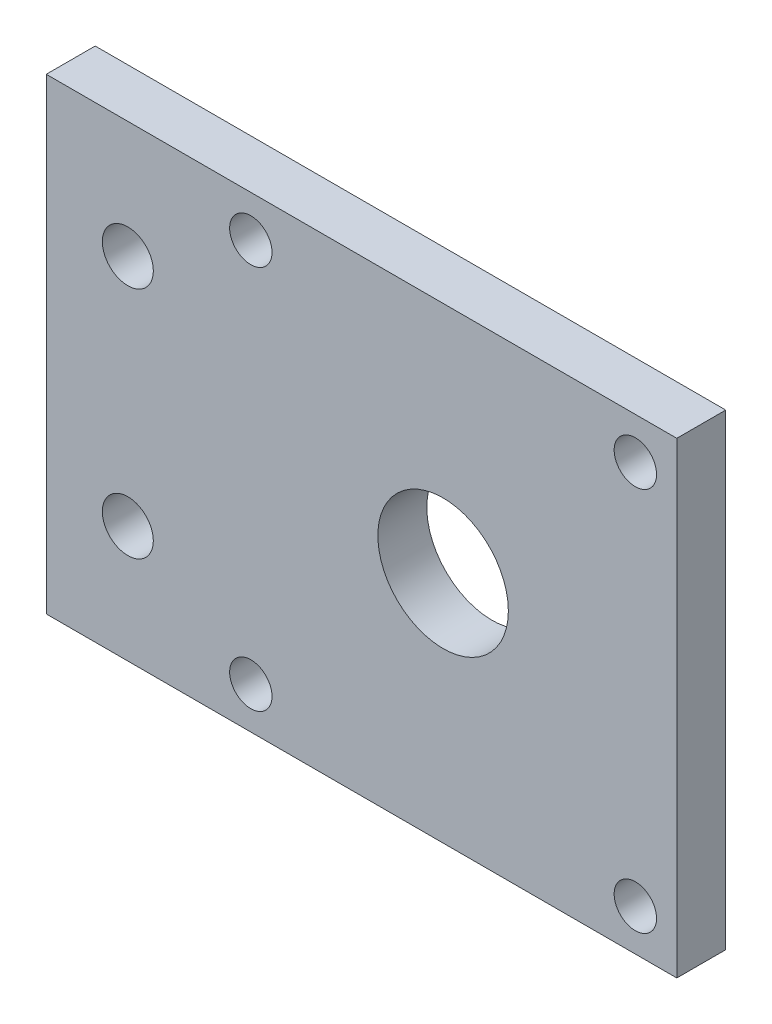
ISO-10303-21;
HEADER;
FILE_DESCRIPTION(('STEP AP214'),'2;1');
FILE_NAME('part.step','',(''),(''),'','','');
FILE_SCHEMA(('AUTOMOTIVE_DESIGN { 1 0 10303 214 1 1 1 1 }'));
ENDSEC;
DATA;
#1=APPLICATION_CONTEXT('core data for automotive mechanical design processes');
#2=APPLICATION_PROTOCOL_DEFINITION('international standard','automotive_design',2000,#1);
#3=PRODUCT_CONTEXT('',#1,'mechanical');
#4=PRODUCT('Part','Part','',(#3));
#5=PRODUCT_RELATED_PRODUCT_CATEGORY('part','',(#4));
#6=PRODUCT_DEFINITION_FORMATION('','',#4);
#7=PRODUCT_DEFINITION_CONTEXT('part definition',#1,'design');
#8=PRODUCT_DEFINITION('design','',#6,#7);
#9=PRODUCT_DEFINITION_SHAPE('','',#8);
#10=(LENGTH_UNIT() NAMED_UNIT(*) SI_UNIT(.MILLI.,.METRE.));
#11=(NAMED_UNIT(*) PLANE_ANGLE_UNIT() SI_UNIT($,.RADIAN.));
#12=(NAMED_UNIT(*) SI_UNIT($,.STERADIAN.) SOLID_ANGLE_UNIT());
#13=UNCERTAINTY_MEASURE_WITH_UNIT(LENGTH_MEASURE(1.E-05),#10,'distance_accuracy_value','');
#14=(GEOMETRIC_REPRESENTATION_CONTEXT(3) GLOBAL_UNCERTAINTY_ASSIGNED_CONTEXT((#13)) GLOBAL_UNIT_ASSIGNED_CONTEXT((#10,
#11,#12)) REPRESENTATION_CONTEXT('',''));
#15=CARTESIAN_POINT('',(0.,0.,0.));
#16=DIRECTION('',(0.,0.,1.));
#17=DIRECTION('',(1.,0.,0.));
#18=AXIS2_PLACEMENT_3D('',#15,#16,#17);
#19=CARTESIAN_POINT('',(38.65,-28.65,6.));
#20=DIRECTION('',(-1.,0.,0.));
#21=DIRECTION('',(0.,0.,1.));
#22=AXIS2_PLACEMENT_3D('',#19,#20,#21);
#23=PLANE('',#22);
#24=DIRECTION('',(0.,1.,0.));
#25=VECTOR('',#24,1.);
#26=CARTESIAN_POINT('',(38.65,-28.65,0.));
#27=LINE('',#26,#25);
#28=CARTESIAN_POINT('',(38.65,-28.65,0.));
#29=VERTEX_POINT('',#28);
#30=CARTESIAN_POINT('',(38.65,28.65,0.));
#31=VERTEX_POINT('',#30);
#32=EDGE_CURVE('E101',#29,#31,#27,.T.);
#33=ORIENTED_EDGE('',*,*,#32,.T.);
#34=DIRECTION('',(0.,0.,-1.));
#35=VECTOR('',#34,1.);
#36=CARTESIAN_POINT('',(38.65,28.65,6.));
#37=LINE('',#36,#35);
#38=CARTESIAN_POINT('',(38.65,28.65,6.));
#39=VERTEX_POINT('',#38);
#40=EDGE_CURVE('E11',#39,#31,#37,.T.);
#41=ORIENTED_EDGE('',*,*,#40,.F.);
#42=DIRECTION('',(0.,1.,0.));
#43=VECTOR('',#42,1.);
#44=CARTESIAN_POINT('',(38.65,-28.65,6.));
#45=LINE('',#44,#43);
#46=CARTESIAN_POINT('',(38.65,-28.65,6.));
#47=VERTEX_POINT('',#46);
#48=EDGE_CURVE('E88',#47,#39,#45,.T.);
#49=ORIENTED_EDGE('',*,*,#48,.F.);
#50=DIRECTION('',(0.,0.,-1.));
#51=VECTOR('',#50,1.);
#52=CARTESIAN_POINT('',(38.65,-28.65,6.));
#53=LINE('',#52,#51);
#54=EDGE_CURVE('E97',#47,#29,#53,.T.);
#55=ORIENTED_EDGE('',*,*,#54,.T.);
#56=EDGE_LOOP('',(#33,#41,#49,#55));
#57=FACE_BOUND('',#56,.T.);
#58=ADVANCED_FACE('F36',(#57),#23,.F.);
#59=CARTESIAN_POINT('',(-38.65,28.65,6.));
#60=DIRECTION('',(0.,-1.,0.));
#61=DIRECTION('',(0.,0.,-1.));
#62=AXIS2_PLACEMENT_3D('',#59,#60,#61);
#63=PLANE('',#62);
#64=DIRECTION('',(-1.,0.,0.));
#65=VECTOR('',#64,1.);
#66=CARTESIAN_POINT('',(-38.65,28.65,0.));
#67=LINE('',#66,#65);
#68=CARTESIAN_POINT('',(-38.65,28.65,0.));
#69=VERTEX_POINT('',#68);
#70=EDGE_CURVE('E92',#31,#69,#67,.T.);
#71=ORIENTED_EDGE('',*,*,#70,.T.);
#72=DIRECTION('',(0.,0.,-1.));
#73=VECTOR('',#72,1.);
#74=CARTESIAN_POINT('',(-38.65,28.65,6.));
#75=LINE('',#74,#73);
#76=CARTESIAN_POINT('',(-38.65,28.65,6.));
#77=VERTEX_POINT('',#76);
#78=EDGE_CURVE('E45',#77,#69,#75,.T.);
#79=ORIENTED_EDGE('',*,*,#78,.F.);
#80=DIRECTION('',(-1.,0.,0.));
#81=VECTOR('',#80,1.);
#82=CARTESIAN_POINT('',(-38.65,28.65,6.));
#83=LINE('',#82,#81);
#84=EDGE_CURVE('E83',#39,#77,#83,.T.);
#85=ORIENTED_EDGE('',*,*,#84,.F.);
#86=ORIENTED_EDGE('',*,*,#40,.T.);
#87=EDGE_LOOP('',(#71,#79,#85,#86));
#88=FACE_BOUND('',#87,.T.);
#89=ADVANCED_FACE('F91',(#88),#63,.F.);
#90=CARTESIAN_POINT('',(-38.65,-28.65,6.));
#91=DIRECTION('',(1.,0.,0.));
#92=DIRECTION('',(0.,0.,-1.));
#93=AXIS2_PLACEMENT_3D('',#90,#91,#92);
#94=PLANE('',#93);
#95=DIRECTION('',(0.,-1.,0.));
#96=VECTOR('',#95,1.);
#97=CARTESIAN_POINT('',(-38.65,-28.65,0.));
#98=LINE('',#97,#96);
#99=CARTESIAN_POINT('',(-38.65,-28.65,0.));
#100=VERTEX_POINT('',#99);
#101=EDGE_CURVE('E70',#69,#100,#98,.T.);
#102=ORIENTED_EDGE('',*,*,#101,.T.);
#103=DIRECTION('',(0.,0.,-1.));
#104=VECTOR('',#103,1.);
#105=CARTESIAN_POINT('',(-38.65,-28.65,6.));
#106=LINE('',#105,#104);
#107=CARTESIAN_POINT('',(-38.65,-28.65,6.));
#108=VERTEX_POINT('',#107);
#109=EDGE_CURVE('E93',#108,#100,#106,.T.);
#110=ORIENTED_EDGE('',*,*,#109,.F.);
#111=DIRECTION('',(0.,-1.,0.));
#112=VECTOR('',#111,1.);
#113=CARTESIAN_POINT('',(-38.65,-28.65,6.));
#114=LINE('',#113,#112);
#115=EDGE_CURVE('E86',#77,#108,#114,.T.);
#116=ORIENTED_EDGE('',*,*,#115,.F.);
#117=ORIENTED_EDGE('',*,*,#78,.T.);
#118=EDGE_LOOP('',(#102,#110,#116,#117));
#119=FACE_BOUND('',#118,.T.);
#120=ADVANCED_FACE('F95',(#119),#94,.F.);
#121=CARTESIAN_POINT('',(-38.65,-28.65,6.));
#122=DIRECTION('',(0.,1.,0.));
#123=DIRECTION('',(0.,0.,1.));
#124=AXIS2_PLACEMENT_3D('',#121,#122,#123);
#125=PLANE('',#124);
#126=DIRECTION('',(1.,0.,0.));
#127=VECTOR('',#126,1.);
#128=CARTESIAN_POINT('',(-38.65,-28.65,0.));
#129=LINE('',#128,#127);
#130=EDGE_CURVE('E76',#100,#29,#129,.T.);
#131=ORIENTED_EDGE('',*,*,#130,.T.);
#132=ORIENTED_EDGE('',*,*,#54,.F.);
#133=DIRECTION('',(1.,0.,0.));
#134=VECTOR('',#133,1.);
#135=CARTESIAN_POINT('',(-38.65,-28.65,6.));
#136=LINE('',#135,#134);
#137=EDGE_CURVE('E53',#108,#47,#136,.T.);
#138=ORIENTED_EDGE('',*,*,#137,.F.);
#139=ORIENTED_EDGE('',*,*,#109,.T.);
#140=EDGE_LOOP('',(#131,#132,#138,#139));
#141=FACE_BOUND('',#140,.T.);
#142=ADVANCED_FACE('F109',(#141),#125,.F.);
#143=CARTESIAN_POINT('',(0.,0.,6.));
#144=DIRECTION('',(0.,0.,-1.));
#145=DIRECTION('',(-1.,0.,0.));
#146=AXIS2_PLACEMENT_3D('',#143,#144,#145);
#147=PLANE('',#146);
#148=CARTESIAN_POINT('',(-28.65,14.325,6.));
#149=DIRECTION('',(0.,0.,1.));
#150=DIRECTION('',(1.,0.,0.));
#151=AXIS2_PLACEMENT_3D('',#148,#149,#150);
#152=CIRCLE('',#151,3.12499999999999);
#153=CARTESIAN_POINT('',(-25.525,14.325,6.));
#154=VERTEX_POINT('',#153);
#155=EDGE_CURVE('E150',#154,#154,#152,.T.);
#156=ORIENTED_EDGE('',*,*,#155,.F.);
#157=EDGE_LOOP('',(#156));
#158=FACE_BOUND('',#157,.T.);
#159=CARTESIAN_POINT('',(-28.65,-14.325,6.));
#160=DIRECTION('',(0.,0.,1.));
#161=DIRECTION('',(1.,0.,0.));
#162=AXIS2_PLACEMENT_3D('',#159,#160,#161);
#163=CIRCLE('',#162,3.12499999999999);
#164=CARTESIAN_POINT('',(-25.525,-14.325,6.));
#165=VERTEX_POINT('',#164);
#166=EDGE_CURVE('E147',#165,#165,#163,.T.);
#167=ORIENTED_EDGE('',*,*,#166,.F.);
#168=EDGE_LOOP('',(#167));
#169=FACE_BOUND('',#168,.T.);
#170=CARTESIAN_POINT('',(-13.57,23.57,6.));
#171=DIRECTION('',(0.,0.,1.));
#172=DIRECTION('',(1.,0.,0.));
#173=AXIS2_PLACEMENT_3D('',#170,#171,#172);
#174=CIRCLE('',#173,2.6);
#175=CARTESIAN_POINT('',(-10.97,23.57,6.));
#176=VERTEX_POINT('',#175);
#177=EDGE_CURVE('E128',#176,#176,#174,.T.);
#178=ORIENTED_EDGE('',*,*,#177,.F.);
#179=EDGE_LOOP('',(#178));
#180=FACE_BOUND('',#179,.T.);
#181=CARTESIAN_POINT('',(33.57,-23.57,6.));
#182=DIRECTION('',(0.,0.,1.));
#183=DIRECTION('',(1.,0.,0.));
#184=AXIS2_PLACEMENT_3D('',#181,#182,#183);
#185=CIRCLE('',#184,2.6);
#186=CARTESIAN_POINT('',(36.17,-23.57,6.));
#187=VERTEX_POINT('',#186);
#188=EDGE_CURVE('E121',#187,#187,#185,.T.);
#189=ORIENTED_EDGE('',*,*,#188,.F.);
#190=EDGE_LOOP('',(#189));
#191=FACE_BOUND('',#190,.T.);
#192=CARTESIAN_POINT('',(33.57,23.57,6.));
#193=DIRECTION('',(0.,0.,1.));
#194=DIRECTION('',(1.,0.,0.));
#195=AXIS2_PLACEMENT_3D('',#192,#193,#194);
#196=CIRCLE('',#195,2.6);
#197=CARTESIAN_POINT('',(36.17,23.57,6.));
#198=VERTEX_POINT('',#197);
#199=EDGE_CURVE('E140',#198,#198,#196,.T.);
#200=ORIENTED_EDGE('',*,*,#199,.F.);
#201=EDGE_LOOP('',(#200));
#202=FACE_BOUND('',#201,.T.);
#203=CARTESIAN_POINT('',(-13.57,-23.57,6.));
#204=DIRECTION('',(0.,0.,1.));
#205=DIRECTION('',(1.,0.,0.));
#206=AXIS2_PLACEMENT_3D('',#203,#204,#205);
#207=CIRCLE('',#206,2.6);
#208=CARTESIAN_POINT('',(-10.97,-23.57,6.));
#209=VERTEX_POINT('',#208);
#210=EDGE_CURVE('E133',#209,#209,#207,.T.);
#211=ORIENTED_EDGE('',*,*,#210,.F.);
#212=EDGE_LOOP('',(#211));
#213=FACE_BOUND('',#212,.T.);
#214=CARTESIAN_POINT('',(10.,0.,6.));
#215=DIRECTION('',(0.,0.,1.));
#216=DIRECTION('',(1.,0.,0.));
#217=AXIS2_PLACEMENT_3D('',#214,#215,#216);
#218=CIRCLE('',#217,8.);
#219=CARTESIAN_POINT('',(18.,0.,6.));
#220=VERTEX_POINT('',#219);
#221=EDGE_CURVE('E115',#220,#220,#218,.T.);
#222=ORIENTED_EDGE('',*,*,#221,.F.);
#223=EDGE_LOOP('',(#222));
#224=FACE_BOUND('',#223,.T.);
#225=ORIENTED_EDGE('',*,*,#48,.T.);
#226=ORIENTED_EDGE('',*,*,#84,.T.);
#227=ORIENTED_EDGE('',*,*,#115,.T.);
#228=ORIENTED_EDGE('',*,*,#137,.T.);
#229=EDGE_LOOP('',(#225,#226,#227,#228));
#230=FACE_BOUND('',#229,.T.);
#231=ADVANCED_FACE('F84',(#158,#169,#180,#191,#202,#213,#224,#230),#147,.F.);
#232=CARTESIAN_POINT('',(0.,0.,0.));
#233=DIRECTION('',(0.,0.,-1.));
#234=DIRECTION('',(-1.,0.,0.));
#235=AXIS2_PLACEMENT_3D('',#232,#233,#234);
#236=PLANE('',#235);
#237=CARTESIAN_POINT('',(-28.65,14.325,0.));
#238=DIRECTION('',(0.,0.,-1.));
#239=DIRECTION('',(-1.,0.,0.));
#240=AXIS2_PLACEMENT_3D('',#237,#238,#239);
#241=CIRCLE('',#240,3.12499999999999);
#242=CARTESIAN_POINT('',(-31.775,14.325,0.));
#243=VERTEX_POINT('',#242);
#244=EDGE_CURVE('E39',#243,#243,#241,.T.);
#245=ORIENTED_EDGE('',*,*,#244,.F.);
#246=EDGE_LOOP('',(#245));
#247=FACE_BOUND('',#246,.T.);
#248=CARTESIAN_POINT('',(-28.65,-14.325,0.));
#249=DIRECTION('',(0.,0.,-1.));
#250=DIRECTION('',(-1.,0.,0.));
#251=AXIS2_PLACEMENT_3D('',#248,#249,#250);
#252=CIRCLE('',#251,3.12499999999999);
#253=CARTESIAN_POINT('',(-31.775,-14.325,0.));
#254=VERTEX_POINT('',#253);
#255=EDGE_CURVE('E137',#254,#254,#252,.T.);
#256=ORIENTED_EDGE('',*,*,#255,.F.);
#257=EDGE_LOOP('',(#256));
#258=FACE_BOUND('',#257,.T.);
#259=CARTESIAN_POINT('',(-13.57,23.57,0.));
#260=DIRECTION('',(0.,0.,1.));
#261=DIRECTION('',(1.,0.,0.));
#262=AXIS2_PLACEMENT_3D('',#259,#260,#261);
#263=CIRCLE('',#262,2.6);
#264=CARTESIAN_POINT('',(-10.97,23.57,0.));
#265=VERTEX_POINT('',#264);
#266=EDGE_CURVE('E118',#265,#265,#263,.T.);
#267=ORIENTED_EDGE('',*,*,#266,.T.);
#268=EDGE_LOOP('',(#267));
#269=FACE_BOUND('',#268,.T.);
#270=CARTESIAN_POINT('',(33.57,-23.57,0.));
#271=DIRECTION('',(0.,0.,1.));
#272=DIRECTION('',(1.,0.,0.));
#273=AXIS2_PLACEMENT_3D('',#270,#271,#272);
#274=CIRCLE('',#273,2.6);
#275=CARTESIAN_POINT('',(36.17,-23.57,0.));
#276=VERTEX_POINT('',#275);
#277=EDGE_CURVE('E124',#276,#276,#274,.T.);
#278=ORIENTED_EDGE('',*,*,#277,.T.);
#279=EDGE_LOOP('',(#278));
#280=FACE_BOUND('',#279,.T.);
#281=CARTESIAN_POINT('',(33.57,23.57,0.));
#282=DIRECTION('',(0.,0.,1.));
#283=DIRECTION('',(1.,0.,0.));
#284=AXIS2_PLACEMENT_3D('',#281,#282,#283);
#285=CIRCLE('',#284,2.6);
#286=CARTESIAN_POINT('',(36.17,23.57,0.));
#287=VERTEX_POINT('',#286);
#288=EDGE_CURVE('E125',#287,#287,#285,.T.);
#289=ORIENTED_EDGE('',*,*,#288,.T.);
#290=EDGE_LOOP('',(#289));
#291=FACE_BOUND('',#290,.T.);
#292=CARTESIAN_POINT('',(-13.57,-23.57,0.));
#293=DIRECTION('',(0.,0.,1.));
#294=DIRECTION('',(1.,0.,0.));
#295=AXIS2_PLACEMENT_3D('',#292,#293,#294);
#296=CIRCLE('',#295,2.6);
#297=CARTESIAN_POINT('',(-10.97,-23.57,0.));
#298=VERTEX_POINT('',#297);
#299=EDGE_CURVE('E136',#298,#298,#296,.T.);
#300=ORIENTED_EDGE('',*,*,#299,.T.);
#301=EDGE_LOOP('',(#300));
#302=FACE_BOUND('',#301,.T.);
#303=CARTESIAN_POINT('',(10.,0.,0.));
#304=DIRECTION('',(0.,0.,1.));
#305=DIRECTION('',(1.,0.,0.));
#306=AXIS2_PLACEMENT_3D('',#303,#304,#305);
#307=CIRCLE('',#306,8.);
#308=CARTESIAN_POINT('',(18.,0.,0.));
#309=VERTEX_POINT('',#308);
#310=EDGE_CURVE('E104',#309,#309,#307,.T.);
#311=ORIENTED_EDGE('',*,*,#310,.T.);
#312=EDGE_LOOP('',(#311));
#313=FACE_BOUND('',#312,.T.);
#314=ORIENTED_EDGE('',*,*,#32,.F.);
#315=ORIENTED_EDGE('',*,*,#130,.F.);
#316=ORIENTED_EDGE('',*,*,#101,.F.);
#317=ORIENTED_EDGE('',*,*,#70,.F.);
#318=EDGE_LOOP('',(#314,#315,#316,#317));
#319=FACE_BOUND('',#318,.T.);
#320=ADVANCED_FACE('F112',(#247,#258,#269,#280,#291,#302,#313,#319),#236,.T.);
#321=CARTESIAN_POINT('',(10.,0.,0.));
#322=DIRECTION('',(0.,0.,1.));
#323=DIRECTION('',(1.,0.,0.));
#324=AXIS2_PLACEMENT_3D('',#321,#322,#323);
#325=CYLINDRICAL_SURFACE('',#324,8.);
#326=ORIENTED_EDGE('',*,*,#310,.F.);
#327=EDGE_LOOP('',(#326));
#328=FACE_BOUND('',#327,.T.);
#329=ORIENTED_EDGE('',*,*,#221,.T.);
#330=EDGE_LOOP('',(#329));
#331=FACE_BOUND('',#330,.T.);
#332=ADVANCED_FACE('F161',(#328,#331),#325,.F.);
#333=CARTESIAN_POINT('',(-13.57,-23.57,0.));
#334=DIRECTION('',(0.,0.,1.));
#335=DIRECTION('',(1.,0.,0.));
#336=AXIS2_PLACEMENT_3D('',#333,#334,#335);
#337=CYLINDRICAL_SURFACE('',#336,2.6);
#338=ORIENTED_EDGE('',*,*,#299,.F.);
#339=EDGE_LOOP('',(#338));
#340=FACE_BOUND('',#339,.T.);
#341=ORIENTED_EDGE('',*,*,#210,.T.);
#342=EDGE_LOOP('',(#341));
#343=FACE_BOUND('',#342,.T.);
#344=ADVANCED_FACE('F177',(#340,#343),#337,.F.);
#345=CARTESIAN_POINT('',(33.57,23.57,0.));
#346=DIRECTION('',(0.,0.,1.));
#347=DIRECTION('',(1.,0.,0.));
#348=AXIS2_PLACEMENT_3D('',#345,#346,#347);
#349=CYLINDRICAL_SURFACE('',#348,2.6);
#350=ORIENTED_EDGE('',*,*,#288,.F.);
#351=EDGE_LOOP('',(#350));
#352=FACE_BOUND('',#351,.T.);
#353=ORIENTED_EDGE('',*,*,#199,.T.);
#354=EDGE_LOOP('',(#353));
#355=FACE_BOUND('',#354,.T.);
#356=ADVANCED_FACE('F220',(#352,#355),#349,.F.);
#357=CARTESIAN_POINT('',(33.57,-23.57,0.));
#358=DIRECTION('',(0.,0.,1.));
#359=DIRECTION('',(1.,0.,0.));
#360=AXIS2_PLACEMENT_3D('',#357,#358,#359);
#361=CYLINDRICAL_SURFACE('',#360,2.6);
#362=ORIENTED_EDGE('',*,*,#277,.F.);
#363=EDGE_LOOP('',(#362));
#364=FACE_BOUND('',#363,.T.);
#365=ORIENTED_EDGE('',*,*,#188,.T.);
#366=EDGE_LOOP('',(#365));
#367=FACE_BOUND('',#366,.T.);
#368=ADVANCED_FACE('F230',(#364,#367),#361,.F.);
#369=CARTESIAN_POINT('',(-13.57,23.57,0.));
#370=DIRECTION('',(0.,0.,1.));
#371=DIRECTION('',(1.,0.,0.));
#372=AXIS2_PLACEMENT_3D('',#369,#370,#371);
#373=CYLINDRICAL_SURFACE('',#372,2.6);
#374=ORIENTED_EDGE('',*,*,#266,.F.);
#375=EDGE_LOOP('',(#374));
#376=FACE_BOUND('',#375,.T.);
#377=ORIENTED_EDGE('',*,*,#177,.T.);
#378=EDGE_LOOP('',(#377));
#379=FACE_BOUND('',#378,.T.);
#380=ADVANCED_FACE('F240',(#376,#379),#373,.F.);
#381=CARTESIAN_POINT('',(-28.65,-14.325,6.));
#382=DIRECTION('',(0.,0.,1.));
#383=DIRECTION('',(1.,0.,0.));
#384=AXIS2_PLACEMENT_3D('',#381,#382,#383);
#385=CYLINDRICAL_SURFACE('',#384,3.12499999999999);
#386=ORIENTED_EDGE('',*,*,#255,.T.);
#387=EDGE_LOOP('',(#386));
#388=FACE_BOUND('',#387,.T.);
#389=ORIENTED_EDGE('',*,*,#166,.T.);
#390=EDGE_LOOP('',(#389));
#391=FACE_BOUND('',#390,.T.);
#392=ADVANCED_FACE('F249',(#388,#391),#385,.F.);
#393=CARTESIAN_POINT('',(-28.65,14.325,6.));
#394=DIRECTION('',(0.,0.,1.));
#395=DIRECTION('',(1.,0.,0.));
#396=AXIS2_PLACEMENT_3D('',#393,#394,#395);
#397=CYLINDRICAL_SURFACE('',#396,3.12499999999999);
#398=ORIENTED_EDGE('',*,*,#244,.T.);
#399=EDGE_LOOP('',(#398));
#400=FACE_BOUND('',#399,.T.);
#401=ORIENTED_EDGE('',*,*,#155,.T.);
#402=EDGE_LOOP('',(#401));
#403=FACE_BOUND('',#402,.T.);
#404=ADVANCED_FACE('F157',(#400,#403),#397,.F.);
#405=CLOSED_SHELL('',(#58,#89,#120,#142,#231,#320,#332,#344,#356,#368,#380,#392,#404));
#406=MANIFOLD_SOLID_BREP('B2',#405);
#407=ADVANCED_BREP_SHAPE_REPRESENTATION('',(#18,#406),#14);
#408=SHAPE_DEFINITION_REPRESENTATION(#9,#407);
ENDSEC;
END-ISO-10303-21;
